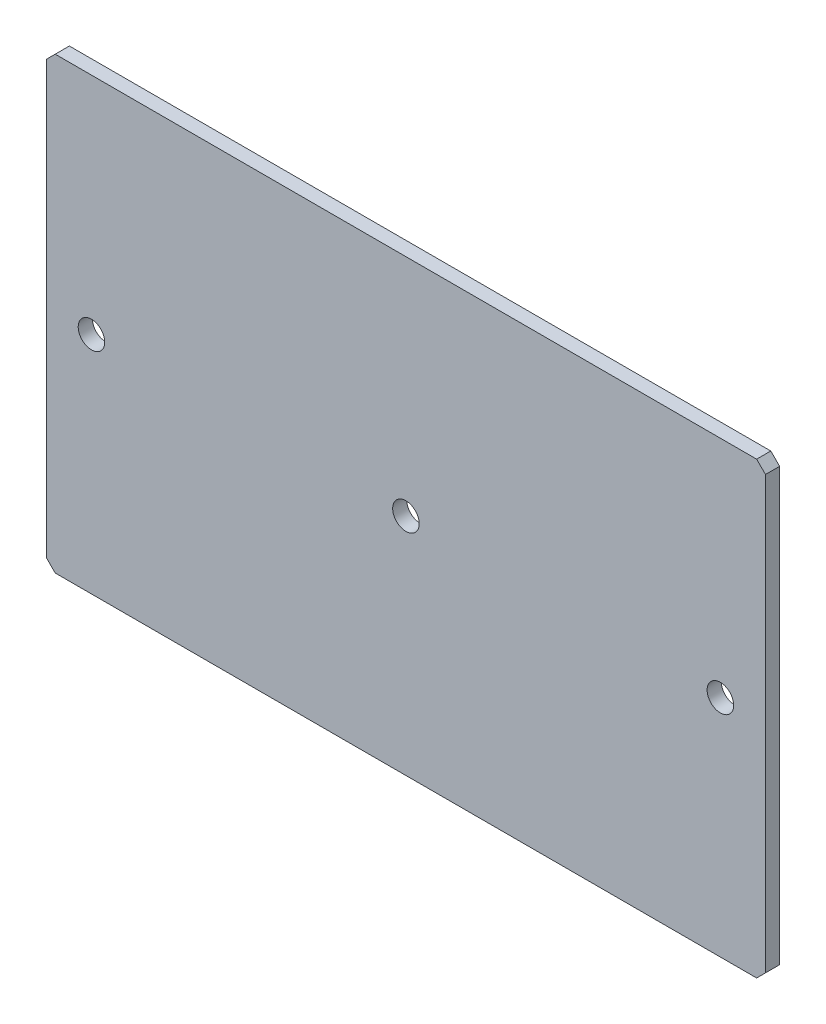
ISO-10303-21;
HEADER;
FILE_DESCRIPTION(('STEP AP214'),'2;1');
FILE_NAME('part.step','',(''),(''),'','','');
FILE_SCHEMA(('AUTOMOTIVE_DESIGN { 1 0 10303 214 1 1 1 1 }'));
ENDSEC;
DATA;
#1=APPLICATION_CONTEXT('core data for automotive mechanical design processes');
#2=APPLICATION_PROTOCOL_DEFINITION('international standard','automotive_design',2000,#1);
#3=PRODUCT_CONTEXT('',#1,'mechanical');
#4=PRODUCT('Part','Part','',(#3));
#5=PRODUCT_RELATED_PRODUCT_CATEGORY('part','',(#4));
#6=PRODUCT_DEFINITION_FORMATION('','',#4);
#7=PRODUCT_DEFINITION_CONTEXT('part definition',#1,'design');
#8=PRODUCT_DEFINITION('design','',#6,#7);
#9=PRODUCT_DEFINITION_SHAPE('','',#8);
#10=(LENGTH_UNIT() NAMED_UNIT(*) SI_UNIT(.MILLI.,.METRE.));
#11=(NAMED_UNIT(*) PLANE_ANGLE_UNIT() SI_UNIT($,.RADIAN.));
#12=(NAMED_UNIT(*) SI_UNIT($,.STERADIAN.) SOLID_ANGLE_UNIT());
#13=UNCERTAINTY_MEASURE_WITH_UNIT(LENGTH_MEASURE(1.E-05),#10,'distance_accuracy_value','');
#14=(GEOMETRIC_REPRESENTATION_CONTEXT(3) GLOBAL_UNCERTAINTY_ASSIGNED_CONTEXT((#13)) GLOBAL_UNIT_ASSIGNED_CONTEXT((#10,
#11,#12)) REPRESENTATION_CONTEXT('',''));
#15=CARTESIAN_POINT('',(0.,0.,0.));
#16=DIRECTION('',(0.,0.,1.));
#17=DIRECTION('',(1.,0.,0.));
#18=AXIS2_PLACEMENT_3D('',#15,#16,#17);
#19=CARTESIAN_POINT('',(0.,0.,1.6));
#20=DIRECTION('',(0.,0.,-1.));
#21=DIRECTION('',(-1.,0.,0.));
#22=AXIS2_PLACEMENT_3D('',#19,#20,#21);
#23=PLANE('',#22);
#24=DIRECTION('',(0.,1.,0.));
#25=VECTOR('',#24,1.);
#26=CARTESIAN_POINT('',(81.3,0.,1.6));
#27=LINE('',#26,#25);
#28=CARTESIAN_POINT('',(81.3,1.,1.6));
#29=VERTEX_POINT('',#28);
#30=CARTESIAN_POINT('',(81.3,49.8,1.6));
#31=VERTEX_POINT('',#30);
#32=EDGE_CURVE('E209',#29,#31,#27,.T.);
#33=ORIENTED_EDGE('',*,*,#32,.T.);
#34=DIRECTION('',(0.707106781186548,-0.707106781186548,0.));
#35=VECTOR('',#34,1.);
#36=CARTESIAN_POINT('',(80.3,50.8,1.6));
#37=LINE('',#36,#35);
#38=CARTESIAN_POINT('',(80.3,50.8,1.6));
#39=VERTEX_POINT('',#38);
#40=EDGE_CURVE('E178',#31,#39,#37,.F.);
#41=ORIENTED_EDGE('',*,*,#40,.T.);
#42=DIRECTION('',(-1.,0.,0.));
#43=VECTOR('',#42,1.);
#44=CARTESIAN_POINT('',(0.,50.8,1.6));
#45=LINE('',#44,#43);
#46=CARTESIAN_POINT('',(1.00000000000003,50.8,1.6));
#47=VERTEX_POINT('',#46);
#48=EDGE_CURVE('E136',#39,#47,#45,.T.);
#49=ORIENTED_EDGE('',*,*,#48,.T.);
#50=DIRECTION('',(0.707106781186557,0.707106781186538,0.));
#51=VECTOR('',#50,1.);
#52=CARTESIAN_POINT('',(0.,49.8,1.6));
#53=LINE('',#52,#51);
#54=CARTESIAN_POINT('',(0.,49.8,1.6));
#55=VERTEX_POINT('',#54);
#56=EDGE_CURVE('E170',#47,#55,#53,.F.);
#57=ORIENTED_EDGE('',*,*,#56,.T.);
#58=DIRECTION('',(0.,-1.,0.));
#59=VECTOR('',#58,1.);
#60=CARTESIAN_POINT('',(0.,0.,1.6));
#61=LINE('',#60,#59);
#62=CARTESIAN_POINT('',(0.,1.,1.6));
#63=VERTEX_POINT('',#62);
#64=EDGE_CURVE('E145',#55,#63,#61,.T.);
#65=ORIENTED_EDGE('',*,*,#64,.T.);
#66=DIRECTION('',(-0.707106781186548,0.707106781186548,0.));
#67=VECTOR('',#66,1.);
#68=CARTESIAN_POINT('',(1.,0.,1.6));
#69=LINE('',#68,#67);
#70=CARTESIAN_POINT('',(1.,0.,1.6));
#71=VERTEX_POINT('',#70);
#72=EDGE_CURVE('E71',#63,#71,#69,.F.);
#73=ORIENTED_EDGE('',*,*,#72,.T.);
#74=DIRECTION('',(1.,0.,0.));
#75=VECTOR('',#74,1.);
#76=CARTESIAN_POINT('',(0.,0.,1.6));
#77=LINE('',#76,#75);
#78=CARTESIAN_POINT('',(80.3,0.,1.6));
#79=VERTEX_POINT('',#78);
#80=EDGE_CURVE('E150',#71,#79,#77,.T.);
#81=ORIENTED_EDGE('',*,*,#80,.T.);
#82=DIRECTION('',(-0.707106781186548,-0.707106781186548,0.));
#83=VECTOR('',#82,1.);
#84=CARTESIAN_POINT('',(81.3,1.,1.6));
#85=LINE('',#84,#83);
#86=EDGE_CURVE('E175',#79,#29,#85,.F.);
#87=ORIENTED_EDGE('',*,*,#86,.T.);
#88=EDGE_LOOP('',(#33,#41,#49,#57,#65,#73,#81,#87));
#89=FACE_BOUND('',#88,.T.);
#90=CARTESIAN_POINT('',(5.1,25.4,1.6));
#91=DIRECTION('',(0.,0.,1.));
#92=DIRECTION('',(1.,0.,0.));
#93=AXIS2_PLACEMENT_3D('',#90,#91,#92);
#94=CIRCLE('',#93,1.5);
#95=CARTESIAN_POINT('',(6.6,25.4,1.6));
#96=VERTEX_POINT('',#95);
#97=EDGE_CURVE('E199',#96,#96,#94,.T.);
#98=ORIENTED_EDGE('',*,*,#97,.F.);
#99=EDGE_LOOP('',(#98));
#100=FACE_BOUND('',#99,.T.);
#101=CARTESIAN_POINT('',(40.65,25.4,1.6));
#102=DIRECTION('',(0.,0.,1.));
#103=DIRECTION('',(1.,0.,0.));
#104=AXIS2_PLACEMENT_3D('',#101,#102,#103);
#105=CIRCLE('',#104,1.5);
#106=CARTESIAN_POINT('',(42.15,25.4,1.6));
#107=VERTEX_POINT('',#106);
#108=EDGE_CURVE('E217',#107,#107,#105,.T.);
#109=ORIENTED_EDGE('',*,*,#108,.F.);
#110=EDGE_LOOP('',(#109));
#111=FACE_BOUND('',#110,.T.);
#112=CARTESIAN_POINT('',(76.2,25.4,1.6));
#113=DIRECTION('',(0.,0.,1.));
#114=DIRECTION('',(1.,0.,0.));
#115=AXIS2_PLACEMENT_3D('',#112,#113,#114);
#116=CIRCLE('',#115,1.5);
#117=CARTESIAN_POINT('',(77.7,25.4,1.6));
#118=VERTEX_POINT('',#117);
#119=EDGE_CURVE('E223',#118,#118,#116,.T.);
#120=ORIENTED_EDGE('',*,*,#119,.F.);
#121=EDGE_LOOP('',(#120));
#122=FACE_BOUND('',#121,.T.);
#123=ADVANCED_FACE('F47',(#89,#100,#111,#122),#23,.F.);
#124=CARTESIAN_POINT('',(0.,0.,0.));
#125=DIRECTION('',(0.,0.,-1.));
#126=DIRECTION('',(-1.,0.,0.));
#127=AXIS2_PLACEMENT_3D('',#124,#125,#126);
#128=PLANE('',#127);
#129=CARTESIAN_POINT('',(40.65,25.4,0.));
#130=DIRECTION('',(0.,0.,1.));
#131=DIRECTION('',(1.,0.,0.));
#132=AXIS2_PLACEMENT_3D('',#129,#130,#131);
#133=CIRCLE('',#132,1.5);
#134=CARTESIAN_POINT('',(42.15,25.4,0.));
#135=VERTEX_POINT('',#134);
#136=EDGE_CURVE('E219',#135,#135,#133,.T.);
#137=ORIENTED_EDGE('',*,*,#136,.T.);
#138=EDGE_LOOP('',(#137));
#139=FACE_BOUND('',#138,.T.);
#140=DIRECTION('',(-1.,0.,0.));
#141=VECTOR('',#140,1.);
#142=CARTESIAN_POINT('',(0.,50.8,0.));
#143=LINE('',#142,#141);
#144=CARTESIAN_POINT('',(80.3,50.8,0.));
#145=VERTEX_POINT('',#144);
#146=CARTESIAN_POINT('',(1.00000000000003,50.8,0.));
#147=VERTEX_POINT('',#146);
#148=EDGE_CURVE('E133',#145,#147,#143,.T.);
#149=ORIENTED_EDGE('',*,*,#148,.F.);
#150=DIRECTION('',(-0.707106781186548,0.707106781186548,0.));
#151=VECTOR('',#150,1.);
#152=CARTESIAN_POINT('',(65.55,65.55,0.));
#153=LINE('',#152,#151);
#154=CARTESIAN_POINT('',(81.3,49.8,0.));
#155=VERTEX_POINT('',#154);
#156=EDGE_CURVE('E115',#145,#155,#153,.F.);
#157=ORIENTED_EDGE('',*,*,#156,.T.);
#158=DIRECTION('',(0.,1.,0.));
#159=VECTOR('',#158,1.);
#160=CARTESIAN_POINT('',(81.3,0.,0.));
#161=LINE('',#160,#159);
#162=CARTESIAN_POINT('',(81.3,1.,0.));
#163=VERTEX_POINT('',#162);
#164=EDGE_CURVE('E146',#163,#155,#161,.T.);
#165=ORIENTED_EDGE('',*,*,#164,.F.);
#166=DIRECTION('',(0.707106781186548,0.707106781186548,0.));
#167=VECTOR('',#166,1.);
#168=CARTESIAN_POINT('',(40.15,-40.15,0.));
#169=LINE('',#168,#167);
#170=CARTESIAN_POINT('',(80.3,0.,0.));
#171=VERTEX_POINT('',#170);
#172=EDGE_CURVE('E127',#163,#171,#169,.F.);
#173=ORIENTED_EDGE('',*,*,#172,.T.);
#174=DIRECTION('',(1.,0.,0.));
#175=VECTOR('',#174,1.);
#176=CARTESIAN_POINT('',(0.,0.,0.));
#177=LINE('',#176,#175);
#178=CARTESIAN_POINT('',(1.,0.,0.));
#179=VERTEX_POINT('',#178);
#180=EDGE_CURVE('E152',#179,#171,#177,.T.);
#181=ORIENTED_EDGE('',*,*,#180,.F.);
#182=DIRECTION('',(0.707106781186548,-0.707106781186548,0.));
#183=VECTOR('',#182,1.);
#184=CARTESIAN_POINT('',(0.5,0.5,0.));
#185=LINE('',#184,#183);
#186=CARTESIAN_POINT('',(0.,1.,0.));
#187=VERTEX_POINT('',#186);
#188=EDGE_CURVE('E160',#179,#187,#185,.F.);
#189=ORIENTED_EDGE('',*,*,#188,.T.);
#190=DIRECTION('',(0.,-1.,0.));
#191=VECTOR('',#190,1.);
#192=CARTESIAN_POINT('',(0.,0.,0.));
#193=LINE('',#192,#191);
#194=CARTESIAN_POINT('',(0.,49.8,0.));
#195=VERTEX_POINT('',#194);
#196=EDGE_CURVE('E193',#195,#187,#193,.T.);
#197=ORIENTED_EDGE('',*,*,#196,.F.);
#198=DIRECTION('',(-0.707106781186557,-0.707106781186538,0.));
#199=VECTOR('',#198,1.);
#200=CARTESIAN_POINT('',(-24.9,24.9000000000007,0.));
#201=LINE('',#200,#199);
#202=EDGE_CURVE('E138',#195,#147,#201,.F.);
#203=ORIENTED_EDGE('',*,*,#202,.T.);
#204=EDGE_LOOP('',(#149,#157,#165,#173,#181,#189,#197,#203));
#205=FACE_BOUND('',#204,.T.);
#206=CARTESIAN_POINT('',(5.1,25.4,0.));
#207=DIRECTION('',(0.,0.,1.));
#208=DIRECTION('',(1.,0.,0.));
#209=AXIS2_PLACEMENT_3D('',#206,#207,#208);
#210=CIRCLE('',#209,1.5);
#211=CARTESIAN_POINT('',(6.6,25.4,0.));
#212=VERTEX_POINT('',#211);
#213=EDGE_CURVE('E204',#212,#212,#210,.T.);
#214=ORIENTED_EDGE('',*,*,#213,.T.);
#215=EDGE_LOOP('',(#214));
#216=FACE_BOUND('',#215,.T.);
#217=CARTESIAN_POINT('',(76.2,25.4,0.));
#218=DIRECTION('',(0.,0.,1.));
#219=DIRECTION('',(1.,0.,0.));
#220=AXIS2_PLACEMENT_3D('',#217,#218,#219);
#221=CIRCLE('',#220,1.5);
#222=CARTESIAN_POINT('',(77.7,25.4,0.));
#223=VERTEX_POINT('',#222);
#224=EDGE_CURVE('E227',#223,#223,#221,.T.);
#225=ORIENTED_EDGE('',*,*,#224,.T.);
#226=EDGE_LOOP('',(#225));
#227=FACE_BOUND('',#226,.T.);
#228=ADVANCED_FACE('F141',(#139,#205,#216,#227),#128,.T.);
#229=CARTESIAN_POINT('',(0.,0.,1.6));
#230=DIRECTION('',(1.,0.,0.));
#231=DIRECTION('',(0.,0.,-1.));
#232=AXIS2_PLACEMENT_3D('',#229,#230,#231);
#233=PLANE('',#232);
#234=ORIENTED_EDGE('',*,*,#196,.T.);
#235=DIRECTION('',(0.,0.,1.));
#236=VECTOR('',#235,1.);
#237=CARTESIAN_POINT('',(0.,1.,1.6));
#238=LINE('',#237,#236);
#239=EDGE_CURVE('E11',#187,#63,#238,.T.);
#240=ORIENTED_EDGE('',*,*,#239,.T.);
#241=ORIENTED_EDGE('',*,*,#64,.F.);
#242=DIRECTION('',(0.,0.,-1.));
#243=VECTOR('',#242,1.);
#244=CARTESIAN_POINT('',(0.,49.8,1.6));
#245=LINE('',#244,#243);
#246=EDGE_CURVE('E57',#55,#195,#245,.T.);
#247=ORIENTED_EDGE('',*,*,#246,.T.);
#248=EDGE_LOOP('',(#234,#240,#241,#247));
#249=FACE_BOUND('',#248,.T.);
#250=ADVANCED_FACE('F192',(#249),#233,.F.);
#251=CARTESIAN_POINT('',(0.,0.,1.6));
#252=DIRECTION('',(0.,1.,0.));
#253=DIRECTION('',(0.,0.,1.));
#254=AXIS2_PLACEMENT_3D('',#251,#252,#253);
#255=PLANE('',#254);
#256=ORIENTED_EDGE('',*,*,#180,.T.);
#257=DIRECTION('',(0.,0.,1.));
#258=VECTOR('',#257,1.);
#259=CARTESIAN_POINT('',(80.3,0.,1.6));
#260=LINE('',#259,#258);
#261=EDGE_CURVE('E64',#171,#79,#260,.T.);
#262=ORIENTED_EDGE('',*,*,#261,.T.);
#263=ORIENTED_EDGE('',*,*,#80,.F.);
#264=DIRECTION('',(0.,0.,-1.));
#265=VECTOR('',#264,1.);
#266=CARTESIAN_POINT('',(1.,0.,1.6));
#267=LINE('',#266,#265);
#268=EDGE_CURVE('E181',#71,#179,#267,.T.);
#269=ORIENTED_EDGE('',*,*,#268,.T.);
#270=EDGE_LOOP('',(#256,#262,#263,#269));
#271=FACE_BOUND('',#270,.T.);
#272=ADVANCED_FACE('F256',(#271),#255,.F.);
#273=CARTESIAN_POINT('',(81.3,0.,1.6));
#274=DIRECTION('',(-1.,0.,0.));
#275=DIRECTION('',(0.,0.,1.));
#276=AXIS2_PLACEMENT_3D('',#273,#274,#275);
#277=PLANE('',#276);
#278=ORIENTED_EDGE('',*,*,#164,.T.);
#279=DIRECTION('',(0.,0.,1.));
#280=VECTOR('',#279,1.);
#281=CARTESIAN_POINT('',(81.3,49.8,1.6));
#282=LINE('',#281,#280);
#283=EDGE_CURVE('E120',#155,#31,#282,.T.);
#284=ORIENTED_EDGE('',*,*,#283,.T.);
#285=ORIENTED_EDGE('',*,*,#32,.F.);
#286=DIRECTION('',(0.,0.,-1.));
#287=VECTOR('',#286,1.);
#288=CARTESIAN_POINT('',(81.3,1.,1.6));
#289=LINE('',#288,#287);
#290=EDGE_CURVE('E126',#29,#163,#289,.T.);
#291=ORIENTED_EDGE('',*,*,#290,.T.);
#292=EDGE_LOOP('',(#278,#284,#285,#291));
#293=FACE_BOUND('',#292,.T.);
#294=ADVANCED_FACE('F253',(#293),#277,.F.);
#295=CARTESIAN_POINT('',(0.,50.8,1.6));
#296=DIRECTION('',(0.,-1.,0.));
#297=DIRECTION('',(0.,0.,-1.));
#298=AXIS2_PLACEMENT_3D('',#295,#296,#297);
#299=PLANE('',#298);
#300=ORIENTED_EDGE('',*,*,#48,.F.);
#301=DIRECTION('',(0.,0.,-1.));
#302=VECTOR('',#301,1.);
#303=CARTESIAN_POINT('',(80.3,50.8,1.6));
#304=LINE('',#303,#302);
#305=EDGE_CURVE('E119',#39,#145,#304,.T.);
#306=ORIENTED_EDGE('',*,*,#305,.T.);
#307=ORIENTED_EDGE('',*,*,#148,.T.);
#308=DIRECTION('',(0.,0.,1.));
#309=VECTOR('',#308,1.);
#310=CARTESIAN_POINT('',(1.00000000000003,50.8,1.6));
#311=LINE('',#310,#309);
#312=EDGE_CURVE('E139',#147,#47,#311,.T.);
#313=ORIENTED_EDGE('',*,*,#312,.T.);
#314=EDGE_LOOP('',(#300,#306,#307,#313));
#315=FACE_BOUND('',#314,.T.);
#316=ADVANCED_FACE('F132',(#315),#299,.F.);
#317=CARTESIAN_POINT('',(5.1,25.4,1.6));
#318=DIRECTION('',(0.,0.,-1.));
#319=DIRECTION('',(-1.,0.,0.));
#320=AXIS2_PLACEMENT_3D('',#317,#318,#319);
#321=CYLINDRICAL_SURFACE('',#320,1.5);
#322=ORIENTED_EDGE('',*,*,#97,.T.);
#323=EDGE_LOOP('',(#322));
#324=FACE_BOUND('',#323,.T.);
#325=ORIENTED_EDGE('',*,*,#213,.F.);
#326=EDGE_LOOP('',(#325));
#327=FACE_BOUND('',#326,.T.);
#328=ADVANCED_FACE('F248',(#324,#327),#321,.F.);
#329=CARTESIAN_POINT('',(40.65,25.4,1.6));
#330=DIRECTION('',(0.,0.,-1.));
#331=DIRECTION('',(-1.,0.,0.));
#332=AXIS2_PLACEMENT_3D('',#329,#330,#331);
#333=CYLINDRICAL_SURFACE('',#332,1.5);
#334=ORIENTED_EDGE('',*,*,#108,.T.);
#335=EDGE_LOOP('',(#334));
#336=FACE_BOUND('',#335,.T.);
#337=ORIENTED_EDGE('',*,*,#136,.F.);
#338=EDGE_LOOP('',(#337));
#339=FACE_BOUND('',#338,.T.);
#340=ADVANCED_FACE('F313',(#336,#339),#333,.F.);
#341=CARTESIAN_POINT('',(76.2,25.4,1.6));
#342=DIRECTION('',(0.,0.,-1.));
#343=DIRECTION('',(-1.,0.,0.));
#344=AXIS2_PLACEMENT_3D('',#341,#342,#343);
#345=CYLINDRICAL_SURFACE('',#344,1.5);
#346=ORIENTED_EDGE('',*,*,#119,.T.);
#347=EDGE_LOOP('',(#346));
#348=FACE_BOUND('',#347,.T.);
#349=ORIENTED_EDGE('',*,*,#224,.F.);
#350=EDGE_LOOP('',(#349));
#351=FACE_BOUND('',#350,.T.);
#352=ADVANCED_FACE('F235',(#348,#351),#345,.F.);
#353=CARTESIAN_POINT('',(80.3,50.8,1.6));
#354=DIRECTION('',(-0.707106781186547,-0.707106781186547,0.));
#355=DIRECTION('',(0.,0.,-1.));
#356=AXIS2_PLACEMENT_3D('',#353,#354,#355);
#357=PLANE('',#356);
#358=ORIENTED_EDGE('',*,*,#40,.F.);
#359=ORIENTED_EDGE('',*,*,#283,.F.);
#360=ORIENTED_EDGE('',*,*,#156,.F.);
#361=ORIENTED_EDGE('',*,*,#305,.F.);
#362=EDGE_LOOP('',(#358,#359,#360,#361));
#363=FACE_BOUND('',#362,.T.);
#364=ADVANCED_FACE('F118',(#363),#357,.F.);
#365=CARTESIAN_POINT('',(81.3,1.,1.6));
#366=DIRECTION('',(-0.707106781186547,0.707106781186547,0.));
#367=DIRECTION('',(0.,0.,-1.));
#368=AXIS2_PLACEMENT_3D('',#365,#366,#367);
#369=PLANE('',#368);
#370=ORIENTED_EDGE('',*,*,#86,.F.);
#371=ORIENTED_EDGE('',*,*,#261,.F.);
#372=ORIENTED_EDGE('',*,*,#172,.F.);
#373=ORIENTED_EDGE('',*,*,#290,.F.);
#374=EDGE_LOOP('',(#370,#371,#372,#373));
#375=FACE_BOUND('',#374,.T.);
#376=ADVANCED_FACE('F268',(#375),#369,.F.);
#377=CARTESIAN_POINT('',(1.,0.,1.6));
#378=DIRECTION('',(0.707106781186547,0.707106781186547,0.));
#379=DIRECTION('',(0.,0.,-1.));
#380=AXIS2_PLACEMENT_3D('',#377,#378,#379);
#381=PLANE('',#380);
#382=ORIENTED_EDGE('',*,*,#72,.F.);
#383=ORIENTED_EDGE('',*,*,#239,.F.);
#384=ORIENTED_EDGE('',*,*,#188,.F.);
#385=ORIENTED_EDGE('',*,*,#268,.F.);
#386=EDGE_LOOP('',(#382,#383,#384,#385));
#387=FACE_BOUND('',#386,.T.);
#388=ADVANCED_FACE('F273',(#387),#381,.F.);
#389=CARTESIAN_POINT('',(0.,49.8,1.6));
#390=DIRECTION('',(0.707106781186538,-0.707106781186557,0.));
#391=DIRECTION('',(0.,0.,-1.));
#392=AXIS2_PLACEMENT_3D('',#389,#390,#391);
#393=PLANE('',#392);
#394=ORIENTED_EDGE('',*,*,#56,.F.);
#395=ORIENTED_EDGE('',*,*,#312,.F.);
#396=ORIENTED_EDGE('',*,*,#202,.F.);
#397=ORIENTED_EDGE('',*,*,#246,.F.);
#398=EDGE_LOOP('',(#394,#395,#396,#397));
#399=FACE_BOUND('',#398,.T.);
#400=ADVANCED_FACE('F50',(#399),#393,.F.);
#401=CLOSED_SHELL('',(#123,#228,#250,#272,#294,#316,#328,#340,#352,#364,#376,#388,#400));
#402=MANIFOLD_SOLID_BREP('B2',#401);
#403=ADVANCED_BREP_SHAPE_REPRESENTATION('',(#18,#402),#14);
#404=SHAPE_DEFINITION_REPRESENTATION(#9,#403);
ENDSEC;
END-ISO-10303-21;
